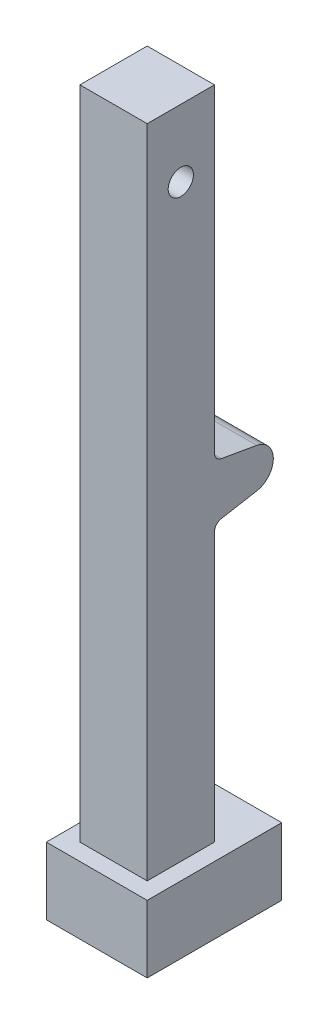
ISO-10303-21;
HEADER;
FILE_DESCRIPTION(('STEP AP214'),'2;1');
FILE_NAME('part.step','',(''),(''),'','','');
FILE_SCHEMA(('AUTOMOTIVE_DESIGN { 1 0 10303 214 1 1 1 1 }'));
ENDSEC;
DATA;
#1=APPLICATION_CONTEXT('core data for automotive mechanical design processes');
#2=APPLICATION_PROTOCOL_DEFINITION('international standard','automotive_design',2000,#1);
#3=PRODUCT_CONTEXT('',#1,'mechanical');
#4=PRODUCT('Part','Part','',(#3));
#5=PRODUCT_RELATED_PRODUCT_CATEGORY('part','',(#4));
#6=PRODUCT_DEFINITION_FORMATION('','',#4);
#7=PRODUCT_DEFINITION_CONTEXT('part definition',#1,'design');
#8=PRODUCT_DEFINITION('design','',#6,#7);
#9=PRODUCT_DEFINITION_SHAPE('','',#8);
#10=(LENGTH_UNIT() NAMED_UNIT(*) SI_UNIT(.MILLI.,.METRE.));
#11=(NAMED_UNIT(*) PLANE_ANGLE_UNIT() SI_UNIT($,.RADIAN.));
#12=(NAMED_UNIT(*) SI_UNIT($,.STERADIAN.) SOLID_ANGLE_UNIT());
#13=UNCERTAINTY_MEASURE_WITH_UNIT(LENGTH_MEASURE(1.E-05),#10,'distance_accuracy_value','');
#14=(GEOMETRIC_REPRESENTATION_CONTEXT(3) GLOBAL_UNCERTAINTY_ASSIGNED_CONTEXT((#13)) GLOBAL_UNIT_ASSIGNED_CONTEXT((#10,
#11,#12)) REPRESENTATION_CONTEXT('',''));
#15=CARTESIAN_POINT('',(0.,0.,0.));
#16=DIRECTION('',(0.,0.,1.));
#17=DIRECTION('',(1.,0.,0.));
#18=AXIS2_PLACEMENT_3D('',#15,#16,#17);
#19=CARTESIAN_POINT('',(-100.,-850.,-215.412320370289));
#20=DIRECTION('',(-1.,0.,0.));
#21=DIRECTION('',(0.,0.,1.));
#22=AXIS2_PLACEMENT_3D('',#19,#20,#21);
#23=CYLINDRICAL_SURFACE('',#22,59.5876796297106);
#24=DIRECTION('',(-1.,0.,0.));
#25=VECTOR('',#24,1.);
#26=CARTESIAN_POINT('',(-100.,-908.682408883347,-225.759612349389));
#27=LINE('',#26,#25);
#28=CARTESIAN_POINT('',(-100.,-908.682408883347,-225.759612349389));
#29=VERTEX_POINT('',#28);
#30=CARTESIAN_POINT('',(100.,-908.682408883347,-225.759612349389));
#31=VERTEX_POINT('',#30);
#32=EDGE_CURVE('E280',#29,#31,#27,.F.);
#33=ORIENTED_EDGE('',*,*,#32,.F.);
#34=CARTESIAN_POINT('',(-100.,-850.,-215.412320370289));
#35=DIRECTION('',(1.,0.,0.));
#36=DIRECTION('',(0.,0.,-1.));
#37=AXIS2_PLACEMENT_3D('',#34,#35,#36);
#38=CIRCLE('',#37,59.5876796297106);
#39=CARTESIAN_POINT('',(-100.,-791.317591116653,-225.759612349389));
#40=VERTEX_POINT('',#39);
#41=EDGE_CURVE('E286',#40,#29,#38,.F.);
#42=ORIENTED_EDGE('',*,*,#41,.F.);
#43=DIRECTION('',(-1.,0.,0.));
#44=VECTOR('',#43,1.);
#45=CARTESIAN_POINT('',(100.,-791.317591116653,-225.759612349389));
#46=LINE('',#45,#44);
#47=CARTESIAN_POINT('',(100.,-791.317591116653,-225.759612349389));
#48=VERTEX_POINT('',#47);
#49=EDGE_CURVE('E283',#48,#40,#46,.T.);
#50=ORIENTED_EDGE('',*,*,#49,.F.);
#51=CARTESIAN_POINT('',(100.,-850.,-215.412320370289));
#52=DIRECTION('',(1.,0.,0.));
#53=DIRECTION('',(0.,0.,-1.));
#54=AXIS2_PLACEMENT_3D('',#51,#52,#53);
#55=CIRCLE('',#54,59.5876796297106);
#56=EDGE_CURVE('E289',#31,#48,#55,.T.);
#57=ORIENTED_EDGE('',*,*,#56,.F.);
#58=EDGE_LOOP('',(#33,#42,#50,#57));
#59=FACE_BOUND('',#58,.T.);
#60=ADVANCED_FACE('F50',(#59),#23,.T.);
#61=CARTESIAN_POINT('',(100.,0.,-99.9999999999998));
#62=DIRECTION('',(0.,0.,-1.));
#63=DIRECTION('',(0.,1.,0.));
#64=AXIS2_PLACEMENT_3D('',#61,#62,#63);
#65=PLANE('',#64);
#66=DIRECTION('',(0.,-1.,0.));
#67=VECTOR('',#66,1.);
#68=CARTESIAN_POINT('',(-100.,0.,-99.9999999999998));
#69=LINE('',#68,#67);
#70=CARTESIAN_POINT('',(-100.,-1950.,-100.));
#71=VERTEX_POINT('',#70);
#72=CARTESIAN_POINT('',(-100.,-2000.,-100.));
#73=VERTEX_POINT('',#72);
#74=EDGE_CURVE('E244',#71,#73,#69,.T.);
#75=ORIENTED_EDGE('',*,*,#74,.F.);
#76=DIRECTION('',(1.,0.,0.));
#77=VECTOR('',#76,1.);
#78=CARTESIAN_POINT('',(100.,-1950.,-100.));
#79=LINE('',#78,#77);
#80=CARTESIAN_POINT('',(100.,-1950.,-100.));
#81=VERTEX_POINT('',#80);
#82=EDGE_CURVE('E214',#71,#81,#79,.T.);
#83=ORIENTED_EDGE('',*,*,#82,.T.);
#84=DIRECTION('',(0.,-1.,0.));
#85=VECTOR('',#84,1.);
#86=CARTESIAN_POINT('',(100.,0.,-99.9999999999998));
#87=LINE('',#86,#85);
#88=CARTESIAN_POINT('',(100.,-2000.,-100.));
#89=VERTEX_POINT('',#88);
#90=EDGE_CURVE('E222',#81,#89,#87,.T.);
#91=ORIENTED_EDGE('',*,*,#90,.T.);
#92=DIRECTION('',(-1.,0.,0.));
#93=VECTOR('',#92,1.);
#94=CARTESIAN_POINT('',(100.,-2000.,-100.));
#95=LINE('',#94,#93);
#96=EDGE_CURVE('E241',#89,#73,#95,.T.);
#97=ORIENTED_EDGE('',*,*,#96,.T.);
#98=EDGE_LOOP('',(#75,#83,#91,#97));
#99=FACE_BOUND('',#98,.T.);
#100=ADVANCED_FACE('F359',(#99),#65,.T.);
#101=CARTESIAN_POINT('',(100.,0.,99.9999999999998));
#102=DIRECTION('',(0.,0.,-1.));
#103=DIRECTION('',(0.,1.,0.));
#104=AXIS2_PLACEMENT_3D('',#101,#102,#103);
#105=PLANE('',#104);
#106=DIRECTION('',(1.,0.,0.));
#107=VECTOR('',#106,1.);
#108=CARTESIAN_POINT('',(100.,-1950.,100.));
#109=LINE('',#108,#107);
#110=CARTESIAN_POINT('',(-100.,-1950.,100.));
#111=VERTEX_POINT('',#110);
#112=CARTESIAN_POINT('',(100.,-1950.,100.));
#113=VERTEX_POINT('',#112);
#114=EDGE_CURVE('E211',#111,#113,#109,.T.);
#115=ORIENTED_EDGE('',*,*,#114,.F.);
#116=DIRECTION('',(0.,-1.,0.));
#117=VECTOR('',#116,1.);
#118=CARTESIAN_POINT('',(-100.,0.,99.9999999999998));
#119=LINE('',#118,#117);
#120=CARTESIAN_POINT('',(-100.,-2000.,100.));
#121=VERTEX_POINT('',#120);
#122=EDGE_CURVE('E255',#111,#121,#119,.T.);
#123=ORIENTED_EDGE('',*,*,#122,.T.);
#124=DIRECTION('',(-1.,0.,0.));
#125=VECTOR('',#124,1.);
#126=CARTESIAN_POINT('',(100.,-2000.,100.));
#127=LINE('',#126,#125);
#128=CARTESIAN_POINT('',(100.,-2000.,100.));
#129=VERTEX_POINT('',#128);
#130=EDGE_CURVE('E263',#129,#121,#127,.T.);
#131=ORIENTED_EDGE('',*,*,#130,.F.);
#132=DIRECTION('',(0.,-1.,0.));
#133=VECTOR('',#132,1.);
#134=CARTESIAN_POINT('',(100.,0.,99.9999999999998));
#135=LINE('',#134,#133);
#136=EDGE_CURVE('E234',#113,#129,#135,.T.);
#137=ORIENTED_EDGE('',*,*,#136,.F.);
#138=EDGE_LOOP('',(#115,#123,#131,#137));
#139=FACE_BOUND('',#138,.T.);
#140=ADVANCED_FACE('F366',(#139),#105,.F.);
#141=CARTESIAN_POINT('',(100.,0.,0.));
#142=DIRECTION('',(1.,0.,0.));
#143=DIRECTION('',(0.,0.,-1.));
#144=AXIS2_PLACEMENT_3D('',#141,#142,#143);
#145=PLANE('',#144);
#146=ORIENTED_EDGE('',*,*,#90,.F.);
#147=DIRECTION('',(0.,0.,1.));
#148=VECTOR('',#147,1.);
#149=CARTESIAN_POINT('',(100.,-1950.,0.));
#150=LINE('',#149,#148);
#151=EDGE_CURVE('E216',#81,#113,#150,.T.);
#152=ORIENTED_EDGE('',*,*,#151,.T.);
#153=ORIENTED_EDGE('',*,*,#136,.T.);
#154=DIRECTION('',(0.,0.,-1.));
#155=VECTOR('',#154,1.);
#156=CARTESIAN_POINT('',(100.,-2000.,0.));
#157=LINE('',#156,#155);
#158=EDGE_CURVE('E238',#129,#89,#157,.T.);
#159=ORIENTED_EDGE('',*,*,#158,.T.);
#160=EDGE_LOOP('',(#146,#152,#153,#159));
#161=FACE_BOUND('',#160,.T.);
#162=ADVANCED_FACE('F410',(#161),#145,.T.);
#163=CARTESIAN_POINT('',(-100.,0.,0.));
#164=DIRECTION('',(1.,0.,0.));
#165=DIRECTION('',(0.,0.,-1.));
#166=AXIS2_PLACEMENT_3D('',#163,#164,#165);
#167=PLANE('',#166);
#168=DIRECTION('',(0.,0.,1.));
#169=VECTOR('',#168,1.);
#170=CARTESIAN_POINT('',(-100.,-1950.,0.));
#171=LINE('',#170,#169);
#172=EDGE_CURVE('E277',#71,#111,#171,.T.);
#173=ORIENTED_EDGE('',*,*,#172,.F.);
#174=ORIENTED_EDGE('',*,*,#74,.T.);
#175=DIRECTION('',(0.,0.,-1.));
#176=VECTOR('',#175,1.);
#177=CARTESIAN_POINT('',(-100.,-2000.,0.));
#178=LINE('',#177,#176);
#179=EDGE_CURVE('E223',#121,#73,#178,.T.);
#180=ORIENTED_EDGE('',*,*,#179,.F.);
#181=ORIENTED_EDGE('',*,*,#122,.F.);
#182=EDGE_LOOP('',(#173,#174,#180,#181));
#183=FACE_BOUND('',#182,.T.);
#184=ADVANCED_FACE('F413',(#183),#167,.F.);
#185=CARTESIAN_POINT('',(100.,-2000.,0.));
#186=DIRECTION('',(0.,1.,0.));
#187=DIRECTION('',(0.,0.,1.));
#188=AXIS2_PLACEMENT_3D('',#185,#186,#187);
#189=PLANE('',#188);
#190=ORIENTED_EDGE('',*,*,#179,.T.);
#191=ORIENTED_EDGE('',*,*,#96,.F.);
#192=ORIENTED_EDGE('',*,*,#158,.F.);
#193=ORIENTED_EDGE('',*,*,#130,.T.);
#194=EDGE_LOOP('',(#190,#191,#192,#193));
#195=FACE_BOUND('',#194,.T.);
#196=ADVANCED_FACE('F406',(#195),#189,.F.);
#197=CARTESIAN_POINT('',(150.,-1950.,149.999999999999));
#198=DIRECTION('',(0.,1.,0.));
#199=DIRECTION('',(0.,0.,1.));
#200=AXIS2_PLACEMENT_3D('',#197,#198,#199);
#201=PLANE('',#200);
#202=ORIENTED_EDGE('',*,*,#151,.F.);
#203=ORIENTED_EDGE('',*,*,#82,.F.);
#204=ORIENTED_EDGE('',*,*,#172,.T.);
#205=ORIENTED_EDGE('',*,*,#114,.T.);
#206=EDGE_LOOP('',(#202,#203,#204,#205));
#207=FACE_BOUND('',#206,.T.);
#208=DIRECTION('',(0.,0.,-1.));
#209=VECTOR('',#208,1.);
#210=CARTESIAN_POINT('',(-150.,-1950.,149.999999999999));
#211=LINE('',#210,#209);
#212=CARTESIAN_POINT('',(-150.,-1950.,149.999999999999));
#213=VERTEX_POINT('',#212);
#214=CARTESIAN_POINT('',(-150.,-1950.,-250.000000000001));
#215=VERTEX_POINT('',#214);
#216=EDGE_CURVE('E197',#213,#215,#211,.T.);
#217=ORIENTED_EDGE('',*,*,#216,.T.);
#218=DIRECTION('',(-1.,0.,0.));
#219=VECTOR('',#218,1.);
#220=CARTESIAN_POINT('',(150.,-1950.,-250.000000000001));
#221=LINE('',#220,#219);
#222=CARTESIAN_POINT('',(150.,-1950.,-250.000000000001));
#223=VERTEX_POINT('',#222);
#224=EDGE_CURVE('E178',#223,#215,#221,.T.);
#225=ORIENTED_EDGE('',*,*,#224,.F.);
#226=DIRECTION('',(0.,0.,-1.));
#227=VECTOR('',#226,1.);
#228=CARTESIAN_POINT('',(150.,-1950.,149.999999999999));
#229=LINE('',#228,#227);
#230=CARTESIAN_POINT('',(150.,-1950.,149.999999999999));
#231=VERTEX_POINT('',#230);
#232=EDGE_CURVE('E185',#231,#223,#229,.T.);
#233=ORIENTED_EDGE('',*,*,#232,.F.);
#234=DIRECTION('',(-1.,0.,0.));
#235=VECTOR('',#234,1.);
#236=CARTESIAN_POINT('',(150.,-1950.,149.999999999999));
#237=LINE('',#236,#235);
#238=EDGE_CURVE('E582',#231,#213,#237,.T.);
#239=ORIENTED_EDGE('',*,*,#238,.T.);
#240=EDGE_LOOP('',(#217,#225,#233,#239));
#241=FACE_BOUND('',#240,.T.);
#242=ADVANCED_FACE('F195',(#207,#241),#201,.F.);
#243=CARTESIAN_POINT('',(150.,-1950.,-250.000000000001));
#244=DIRECTION('',(0.,0.,1.));
#245=DIRECTION('',(1.,0.,0.));
#246=AXIS2_PLACEMENT_3D('',#243,#244,#245);
#247=PLANE('',#246);
#248=DIRECTION('',(0.,1.,0.));
#249=VECTOR('',#248,1.);
#250=CARTESIAN_POINT('',(-150.,-1950.,-250.000000000001));
#251=LINE('',#250,#249);
#252=CARTESIAN_POINT('',(-150.,-1750.,-250.000000000001));
#253=VERTEX_POINT('',#252);
#254=EDGE_CURVE('E587',#215,#253,#251,.T.);
#255=ORIENTED_EDGE('',*,*,#254,.T.);
#256=DIRECTION('',(-1.,0.,0.));
#257=VECTOR('',#256,1.);
#258=CARTESIAN_POINT('',(150.,-1750.,-250.000000000001));
#259=LINE('',#258,#257);
#260=CARTESIAN_POINT('',(150.,-1750.,-250.000000000001));
#261=VERTEX_POINT('',#260);
#262=EDGE_CURVE('E180',#261,#253,#259,.T.);
#263=ORIENTED_EDGE('',*,*,#262,.F.);
#264=DIRECTION('',(0.,1.,0.));
#265=VECTOR('',#264,1.);
#266=CARTESIAN_POINT('',(150.,-1950.,-250.000000000001));
#267=LINE('',#266,#265);
#268=EDGE_CURVE('E173',#223,#261,#267,.T.);
#269=ORIENTED_EDGE('',*,*,#268,.F.);
#270=ORIENTED_EDGE('',*,*,#224,.T.);
#271=EDGE_LOOP('',(#255,#263,#269,#270));
#272=FACE_BOUND('',#271,.T.);
#273=ADVANCED_FACE('F176',(#272),#247,.F.);
#274=CARTESIAN_POINT('',(150.,-1750.,149.999999999999));
#275=DIRECTION('',(0.,1.,0.));
#276=DIRECTION('',(0.,0.,1.));
#277=AXIS2_PLACEMENT_3D('',#274,#275,#276);
#278=PLANE('',#277);
#279=DIRECTION('',(1.,0.,0.));
#280=VECTOR('',#279,1.);
#281=CARTESIAN_POINT('',(100.,-1750.,-100.));
#282=LINE('',#281,#280);
#283=CARTESIAN_POINT('',(-100.,-1750.,-99.9999999999999));
#284=VERTEX_POINT('',#283);
#285=CARTESIAN_POINT('',(100.,-1750.,-100.));
#286=VERTEX_POINT('',#285);
#287=EDGE_CURVE('E201',#284,#286,#282,.T.);
#288=ORIENTED_EDGE('',*,*,#287,.T.);
#289=DIRECTION('',(0.,0.,1.));
#290=VECTOR('',#289,1.);
#291=CARTESIAN_POINT('',(100.,-1750.,0.));
#292=LINE('',#291,#290);
#293=CARTESIAN_POINT('',(100.,-1750.,100.));
#294=VERTEX_POINT('',#293);
#295=EDGE_CURVE('E209',#286,#294,#292,.T.);
#296=ORIENTED_EDGE('',*,*,#295,.T.);
#297=DIRECTION('',(1.,0.,0.));
#298=VECTOR('',#297,1.);
#299=CARTESIAN_POINT('',(100.,-1750.,100.));
#300=LINE('',#299,#298);
#301=CARTESIAN_POINT('',(-100.,-1750.,100.));
#302=VERTEX_POINT('',#301);
#303=EDGE_CURVE('E198',#302,#294,#300,.T.);
#304=ORIENTED_EDGE('',*,*,#303,.F.);
#305=DIRECTION('',(0.,0.,1.));
#306=VECTOR('',#305,1.);
#307=CARTESIAN_POINT('',(-100.,-1750.,0.));
#308=LINE('',#307,#306);
#309=EDGE_CURVE('E270',#284,#302,#308,.T.);
#310=ORIENTED_EDGE('',*,*,#309,.F.);
#311=EDGE_LOOP('',(#288,#296,#304,#310));
#312=FACE_BOUND('',#311,.T.);
#313=DIRECTION('',(0.,0.,-1.));
#314=VECTOR('',#313,1.);
#315=CARTESIAN_POINT('',(-150.,-1750.,149.999999999999));
#316=LINE('',#315,#314);
#317=CARTESIAN_POINT('',(-150.,-1750.,149.999999999999));
#318=VERTEX_POINT('',#317);
#319=EDGE_CURVE('E585',#318,#253,#316,.T.);
#320=ORIENTED_EDGE('',*,*,#319,.F.);
#321=DIRECTION('',(-1.,0.,0.));
#322=VECTOR('',#321,1.);
#323=CARTESIAN_POINT('',(150.,-1750.,149.999999999999));
#324=LINE('',#323,#322);
#325=CARTESIAN_POINT('',(150.,-1750.,149.999999999999));
#326=VERTEX_POINT('',#325);
#327=EDGE_CURVE('E203',#326,#318,#324,.T.);
#328=ORIENTED_EDGE('',*,*,#327,.F.);
#329=DIRECTION('',(0.,0.,-1.));
#330=VECTOR('',#329,1.);
#331=CARTESIAN_POINT('',(150.,-1750.,149.999999999999));
#332=LINE('',#331,#330);
#333=EDGE_CURVE('E184',#326,#261,#332,.T.);
#334=ORIENTED_EDGE('',*,*,#333,.T.);
#335=ORIENTED_EDGE('',*,*,#262,.T.);
#336=EDGE_LOOP('',(#320,#328,#334,#335));
#337=FACE_BOUND('',#336,.T.);
#338=ADVANCED_FACE('F338',(#312,#337),#278,.T.);
#339=CARTESIAN_POINT('',(150.,-1950.,149.999999999999));
#340=DIRECTION('',(0.,0.,1.));
#341=DIRECTION('',(0.,-1.,0.));
#342=AXIS2_PLACEMENT_3D('',#339,#340,#341);
#343=PLANE('',#342);
#344=DIRECTION('',(0.,1.,0.));
#345=VECTOR('',#344,1.);
#346=CARTESIAN_POINT('',(-150.,-1950.,149.999999999999));
#347=LINE('',#346,#345);
#348=EDGE_CURVE('E193',#213,#318,#347,.T.);
#349=ORIENTED_EDGE('',*,*,#348,.F.);
#350=ORIENTED_EDGE('',*,*,#238,.F.);
#351=DIRECTION('',(0.,1.,0.));
#352=VECTOR('',#351,1.);
#353=CARTESIAN_POINT('',(150.,-1950.,149.999999999999));
#354=LINE('',#353,#352);
#355=EDGE_CURVE('E191',#231,#326,#354,.T.);
#356=ORIENTED_EDGE('',*,*,#355,.T.);
#357=ORIENTED_EDGE('',*,*,#327,.T.);
#358=EDGE_LOOP('',(#349,#350,#356,#357));
#359=FACE_BOUND('',#358,.T.);
#360=ADVANCED_FACE('F394',(#359),#343,.T.);
#361=CARTESIAN_POINT('',(150.,0.,0.));
#362=DIRECTION('',(1.,0.,0.));
#363=DIRECTION('',(0.,0.,-1.));
#364=AXIS2_PLACEMENT_3D('',#361,#362,#363);
#365=PLANE('',#364);
#366=ORIENTED_EDGE('',*,*,#232,.T.);
#367=ORIENTED_EDGE('',*,*,#268,.T.);
#368=ORIENTED_EDGE('',*,*,#333,.F.);
#369=ORIENTED_EDGE('',*,*,#355,.F.);
#370=EDGE_LOOP('',(#366,#367,#368,#369));
#371=FACE_BOUND('',#370,.T.);
#372=ADVANCED_FACE('F189',(#371),#365,.T.);
#373=CARTESIAN_POINT('',(-150.,0.,0.));
#374=DIRECTION('',(1.,0.,0.));
#375=DIRECTION('',(0.,0.,-1.));
#376=AXIS2_PLACEMENT_3D('',#373,#374,#375);
#377=PLANE('',#376);
#378=ORIENTED_EDGE('',*,*,#216,.F.);
#379=ORIENTED_EDGE('',*,*,#348,.T.);
#380=ORIENTED_EDGE('',*,*,#319,.T.);
#381=ORIENTED_EDGE('',*,*,#254,.F.);
#382=EDGE_LOOP('',(#378,#379,#380,#381));
#383=FACE_BOUND('',#382,.T.);
#384=ADVANCED_FACE('F385',(#383),#377,.F.);
#385=CARTESIAN_POINT('',(100.,-900.,-275.));
#386=DIRECTION('',(0.,-0.984807753012208,-0.173648177666931));
#387=DIRECTION('',(0.,0.173648177666931,-0.984807753012208));
#388=AXIS2_PLACEMENT_3D('',#385,#386,#387);
#389=PLANE('',#388);
#390=DIRECTION('',(0.,-0.173648177666931,0.984807753012208));
#391=VECTOR('',#390,1.);
#392=CARTESIAN_POINT('',(100.,-900.,-275.));
#393=LINE('',#392,#391);
#394=CARTESIAN_POINT('',(100.,-927.214518578108,-120.658795558327));
#395=VERTEX_POINT('',#394);
#396=EDGE_CURVE('E226',#395,#31,#393,.F.);
#397=ORIENTED_EDGE('',*,*,#396,.F.);
#398=DIRECTION('',(-1.,0.,0.));
#399=VECTOR('',#398,1.);
#400=CARTESIAN_POINT('',(100.,-927.214518578108,-120.658795558327));
#401=LINE('',#400,#399);
#402=CARTESIAN_POINT('',(-100.,-927.214518578108,-120.658795558327));
#403=VERTEX_POINT('',#402);
#404=EDGE_CURVE('E297',#395,#403,#401,.T.);
#405=ORIENTED_EDGE('',*,*,#404,.T.);
#406=DIRECTION('',(0.,-0.173648177666931,0.984807753012208));
#407=VECTOR('',#406,1.);
#408=CARTESIAN_POINT('',(-100.,-900.,-275.));
#409=LINE('',#408,#407);
#410=EDGE_CURVE('E247',#403,#29,#409,.F.);
#411=ORIENTED_EDGE('',*,*,#410,.T.);
#412=ORIENTED_EDGE('',*,*,#32,.T.);
#413=EDGE_LOOP('',(#397,#405,#411,#412));
#414=FACE_BOUND('',#413,.T.);
#415=ADVANCED_FACE('F329',(#414),#389,.T.);
#416=CARTESIAN_POINT('',(100.,-800.,-275.));
#417=DIRECTION('',(0.,0.984807753012208,-0.173648177666931));
#418=DIRECTION('',(0.,0.173648177666931,0.984807753012208));
#419=AXIS2_PLACEMENT_3D('',#416,#417,#418);
#420=PLANE('',#419);
#421=DIRECTION('',(0.,-0.173648177666931,-0.984807753012208));
#422=VECTOR('',#421,1.);
#423=CARTESIAN_POINT('',(-100.,-800.,-275.));
#424=LINE('',#423,#422);
#425=CARTESIAN_POINT('',(-100.,-772.785481421892,-120.658795558327));
#426=VERTEX_POINT('',#425);
#427=EDGE_CURVE('E252',#426,#40,#424,.T.);
#428=ORIENTED_EDGE('',*,*,#427,.F.);
#429=DIRECTION('',(-1.,0.,0.));
#430=VECTOR('',#429,1.);
#431=CARTESIAN_POINT('',(100.,-772.785481421892,-120.658795558327));
#432=LINE('',#431,#430);
#433=CARTESIAN_POINT('',(100.,-772.785481421892,-120.658795558327));
#434=VERTEX_POINT('',#433);
#435=EDGE_CURVE('E295',#426,#434,#432,.F.);
#436=ORIENTED_EDGE('',*,*,#435,.T.);
#437=DIRECTION('',(0.,-0.173648177666931,-0.984807753012208));
#438=VECTOR('',#437,1.);
#439=CARTESIAN_POINT('',(100.,-800.,-275.));
#440=LINE('',#439,#438);
#441=EDGE_CURVE('E231',#434,#48,#440,.T.);
#442=ORIENTED_EDGE('',*,*,#441,.T.);
#443=ORIENTED_EDGE('',*,*,#49,.T.);
#444=EDGE_LOOP('',(#428,#436,#442,#443));
#445=FACE_BOUND('',#444,.T.);
#446=ADVANCED_FACE('F322',(#445),#420,.T.);
#447=CARTESIAN_POINT('',(100.,0.,-99.9999999999998));
#448=DIRECTION('',(0.,0.,-1.));
#449=DIRECTION('',(0.,1.,0.));
#450=AXIS2_PLACEMENT_3D('',#447,#448,#449);
#451=PLANE('',#450);
#452=DIRECTION('',(0.,-1.,0.));
#453=VECTOR('',#452,1.);
#454=CARTESIAN_POINT('',(100.,0.,-99.9999999999998));
#455=LINE('',#454,#453);
#456=CARTESIAN_POINT('',(100.,200.,-99.9999999999998));
#457=VERTEX_POINT('',#456);
#458=CARTESIAN_POINT('',(100.,-748.165287596586,-99.9999999999998));
#459=VERTEX_POINT('',#458);
#460=EDGE_CURVE('E227',#457,#459,#455,.T.);
#461=ORIENTED_EDGE('',*,*,#460,.T.);
#462=DIRECTION('',(-1.,0.,0.));
#463=VECTOR('',#462,1.);
#464=CARTESIAN_POINT('',(-100.,-748.165287596586,-99.9999999999998));
#465=LINE('',#464,#463);
#466=CARTESIAN_POINT('',(-100.,-748.165287596586,-99.9999999999998));
#467=VERTEX_POINT('',#466);
#468=EDGE_CURVE('E292',#459,#467,#465,.T.);
#469=ORIENTED_EDGE('',*,*,#468,.T.);
#470=DIRECTION('',(0.,-1.,0.));
#471=VECTOR('',#470,1.);
#472=CARTESIAN_POINT('',(-100.,0.,-99.9999999999998));
#473=LINE('',#472,#471);
#474=CARTESIAN_POINT('',(-100.,200.,-99.9999999999998));
#475=VERTEX_POINT('',#474);
#476=EDGE_CURVE('E248',#475,#467,#473,.T.);
#477=ORIENTED_EDGE('',*,*,#476,.F.);
#478=DIRECTION('',(-1.,0.,0.));
#479=VECTOR('',#478,1.);
#480=CARTESIAN_POINT('',(100.,200.,-99.9999999999998));
#481=LINE('',#480,#479);
#482=EDGE_CURVE('E268',#457,#475,#481,.T.);
#483=ORIENTED_EDGE('',*,*,#482,.F.);
#484=EDGE_LOOP('',(#461,#469,#477,#483));
#485=FACE_BOUND('',#484,.T.);
#486=ADVANCED_FACE('F315',(#485),#451,.T.);
#487=CARTESIAN_POINT('',(100.,200.,0.));
#488=DIRECTION('',(0.,1.,0.));
#489=DIRECTION('',(0.,0.,1.));
#490=AXIS2_PLACEMENT_3D('',#487,#488,#489);
#491=PLANE('',#490);
#492=DIRECTION('',(0.,0.,-1.));
#493=VECTOR('',#492,1.);
#494=CARTESIAN_POINT('',(-100.,200.,0.));
#495=LINE('',#494,#493);
#496=CARTESIAN_POINT('',(-100.,200.,99.9999999999998));
#497=VERTEX_POINT('',#496);
#498=EDGE_CURVE('E251',#497,#475,#495,.T.);
#499=ORIENTED_EDGE('',*,*,#498,.F.);
#500=DIRECTION('',(-1.,0.,0.));
#501=VECTOR('',#500,1.);
#502=CARTESIAN_POINT('',(100.,200.,99.9999999999998));
#503=LINE('',#502,#501);
#504=CARTESIAN_POINT('',(100.,200.,99.9999999999998));
#505=VERTEX_POINT('',#504);
#506=EDGE_CURVE('E266',#505,#497,#503,.T.);
#507=ORIENTED_EDGE('',*,*,#506,.F.);
#508=DIRECTION('',(0.,0.,-1.));
#509=VECTOR('',#508,1.);
#510=CARTESIAN_POINT('',(100.,200.,0.));
#511=LINE('',#510,#509);
#512=EDGE_CURVE('E230',#505,#457,#511,.T.);
#513=ORIENTED_EDGE('',*,*,#512,.T.);
#514=ORIENTED_EDGE('',*,*,#482,.T.);
#515=EDGE_LOOP('',(#499,#507,#513,#514));
#516=FACE_BOUND('',#515,.T.);
#517=ADVANCED_FACE('F346',(#516),#491,.T.);
#518=CARTESIAN_POINT('',(100.,0.,0.));
#519=DIRECTION('',(-1.,0.,0.));
#520=DIRECTION('',(0.,0.,1.));
#521=AXIS2_PLACEMENT_3D('',#518,#519,#520);
#522=CYLINDRICAL_SURFACE('',#521,37.5);
#523=CARTESIAN_POINT('',(100.,0.,0.));
#524=DIRECTION('',(1.,0.,0.));
#525=DIRECTION('',(0.,0.,-1.));
#526=AXIS2_PLACEMENT_3D('',#523,#524,#525);
#527=CIRCLE('',#526,37.5);
#528=CARTESIAN_POINT('',(100.,0.,-37.5));
#529=VERTEX_POINT('',#528);
#530=EDGE_CURVE('E219',#529,#529,#527,.T.);
#531=ORIENTED_EDGE('',*,*,#530,.T.);
#532=EDGE_LOOP('',(#531));
#533=FACE_BOUND('',#532,.T.);
#534=CARTESIAN_POINT('',(-100.,0.,0.));
#535=DIRECTION('',(1.,0.,0.));
#536=DIRECTION('',(0.,0.,-1.));
#537=AXIS2_PLACEMENT_3D('',#534,#535,#536);
#538=CIRCLE('',#537,37.5);
#539=CARTESIAN_POINT('',(-100.,0.,-37.5));
#540=VERTEX_POINT('',#539);
#541=EDGE_CURVE('E218',#540,#540,#538,.T.);
#542=ORIENTED_EDGE('',*,*,#541,.F.);
#543=EDGE_LOOP('',(#542));
#544=FACE_BOUND('',#543,.T.);
#545=ADVANCED_FACE('F348',(#533,#544),#522,.F.);
#546=CARTESIAN_POINT('',(100.,-951.834712403413,-99.9999999999999));
#547=VERTEX_POINT('',#546);
#548=EDGE_CURVE('E224',#547,#286,#87,.T.);
#549=ORIENTED_EDGE('',*,*,#548,.F.);
#550=CARTESIAN_POINT('',(100.,-951.834712403413,-125.));
#551=DIRECTION('',(1.,0.,0.));
#552=DIRECTION('',(0.,0.,-1.));
#553=AXIS2_PLACEMENT_3D('',#550,#551,#552);
#554=CIRCLE('',#553,25.);
#555=EDGE_CURVE('E12',#547,#395,#554,.F.);
#556=ORIENTED_EDGE('',*,*,#555,.T.);
#557=ORIENTED_EDGE('',*,*,#396,.T.);
#558=ORIENTED_EDGE('',*,*,#56,.T.);
#559=ORIENTED_EDGE('',*,*,#441,.F.);
#560=CARTESIAN_POINT('',(100.,-748.165287596586,-125.));
#561=DIRECTION('',(1.,0.,0.));
#562=DIRECTION('',(0.,0.,-1.));
#563=AXIS2_PLACEMENT_3D('',#560,#561,#562);
#564=CIRCLE('',#563,25.);
#565=EDGE_CURVE('E303',#434,#459,#564,.F.);
#566=ORIENTED_EDGE('',*,*,#565,.T.);
#567=ORIENTED_EDGE('',*,*,#460,.F.);
#568=ORIENTED_EDGE('',*,*,#512,.F.);
#569=EDGE_CURVE('E235',#505,#294,#135,.T.);
#570=ORIENTED_EDGE('',*,*,#569,.T.);
#571=ORIENTED_EDGE('',*,*,#295,.F.);
#572=EDGE_LOOP('',(#549,#556,#557,#558,#559,#566,#567,#568,#570,#571));
#573=FACE_BOUND('',#572,.T.);
#574=ORIENTED_EDGE('',*,*,#530,.F.);
#575=EDGE_LOOP('',(#574));
#576=FACE_BOUND('',#575,.T.);
#577=ADVANCED_FACE('F308',(#573,#576),#145,.T.);
#578=ORIENTED_EDGE('',*,*,#541,.T.);
#579=EDGE_LOOP('',(#578));
#580=FACE_BOUND('',#579,.T.);
#581=ORIENTED_EDGE('',*,*,#476,.T.);
#582=CARTESIAN_POINT('',(-100.,-748.165287596586,-125.));
#583=DIRECTION('',(1.,0.,0.));
#584=DIRECTION('',(0.,0.,-1.));
#585=AXIS2_PLACEMENT_3D('',#582,#583,#584);
#586=CIRCLE('',#585,25.);
#587=EDGE_CURVE('E301',#467,#426,#586,.T.);
#588=ORIENTED_EDGE('',*,*,#587,.T.);
#589=ORIENTED_EDGE('',*,*,#427,.T.);
#590=ORIENTED_EDGE('',*,*,#41,.T.);
#591=ORIENTED_EDGE('',*,*,#410,.F.);
#592=CARTESIAN_POINT('',(-100.,-951.834712403413,-125.));
#593=DIRECTION('',(1.,0.,0.));
#594=DIRECTION('',(0.,0.,-1.));
#595=AXIS2_PLACEMENT_3D('',#592,#593,#594);
#596=CIRCLE('',#595,25.);
#597=CARTESIAN_POINT('',(-100.,-951.834712403413,-99.9999999999999));
#598=VERTEX_POINT('',#597);
#599=EDGE_CURVE('E58',#403,#598,#596,.T.);
#600=ORIENTED_EDGE('',*,*,#599,.T.);
#601=EDGE_CURVE('E245',#598,#284,#69,.T.);
#602=ORIENTED_EDGE('',*,*,#601,.T.);
#603=ORIENTED_EDGE('',*,*,#309,.T.);
#604=EDGE_CURVE('E256',#497,#302,#119,.T.);
#605=ORIENTED_EDGE('',*,*,#604,.F.);
#606=ORIENTED_EDGE('',*,*,#498,.T.);
#607=EDGE_LOOP('',(#581,#588,#589,#590,#591,#600,#602,#603,#605,#606));
#608=FACE_BOUND('',#607,.T.);
#609=ADVANCED_FACE('F319',(#580,#608),#167,.F.);
#610=ORIENTED_EDGE('',*,*,#604,.T.);
#611=ORIENTED_EDGE('',*,*,#303,.T.);
#612=ORIENTED_EDGE('',*,*,#569,.F.);
#613=ORIENTED_EDGE('',*,*,#506,.T.);
#614=EDGE_LOOP('',(#610,#611,#612,#613));
#615=FACE_BOUND('',#614,.T.);
#616=ADVANCED_FACE('F343',(#615),#105,.F.);
#617=ORIENTED_EDGE('',*,*,#601,.F.);
#618=DIRECTION('',(1.,0.,0.));
#619=VECTOR('',#618,1.);
#620=CARTESIAN_POINT('',(100.,-951.834712403413,-99.9999999999999));
#621=LINE('',#620,#619);
#622=EDGE_CURVE('E65',#598,#547,#621,.T.);
#623=ORIENTED_EDGE('',*,*,#622,.T.);
#624=ORIENTED_EDGE('',*,*,#548,.T.);
#625=ORIENTED_EDGE('',*,*,#287,.F.);
#626=EDGE_LOOP('',(#617,#623,#624,#625));
#627=FACE_BOUND('',#626,.T.);
#628=ADVANCED_FACE('F335',(#627),#65,.T.);
#629=CARTESIAN_POINT('',(100.,-748.165287596586,-125.));
#630=DIRECTION('',(1.,0.,0.));
#631=DIRECTION('',(0.,0.,-1.));
#632=AXIS2_PLACEMENT_3D('',#629,#630,#631);
#633=CYLINDRICAL_SURFACE('',#632,25.);
#634=ORIENTED_EDGE('',*,*,#565,.F.);
#635=ORIENTED_EDGE('',*,*,#435,.F.);
#636=ORIENTED_EDGE('',*,*,#587,.F.);
#637=ORIENTED_EDGE('',*,*,#468,.F.);
#638=EDGE_LOOP('',(#634,#635,#636,#637));
#639=FACE_BOUND('',#638,.T.);
#640=ADVANCED_FACE('F317',(#639),#633,.F.);
#641=CARTESIAN_POINT('',(100.,-951.834712403413,-125.));
#642=DIRECTION('',(1.,0.,0.));
#643=DIRECTION('',(0.,0.,-1.));
#644=AXIS2_PLACEMENT_3D('',#641,#642,#643);
#645=CYLINDRICAL_SURFACE('',#644,25.);
#646=ORIENTED_EDGE('',*,*,#555,.F.);
#647=ORIENTED_EDGE('',*,*,#622,.F.);
#648=ORIENTED_EDGE('',*,*,#599,.F.);
#649=ORIENTED_EDGE('',*,*,#404,.F.);
#650=EDGE_LOOP('',(#646,#647,#648,#649));
#651=FACE_BOUND('',#650,.T.);
#652=ADVANCED_FACE('F52',(#651),#645,.F.);
#653=CLOSED_SHELL('',(#60,#100,#140,#162,#184,#196,#242,#273,#338,#360,#372,#384,#415,#446,#486,
#517,#545,#577,#609,#616,#628,#640,#652));
#654=MANIFOLD_SOLID_BREP('B2',#653);
#655=ADVANCED_BREP_SHAPE_REPRESENTATION('',(#18,#654),#14);
#656=SHAPE_DEFINITION_REPRESENTATION(#9,#655);
ENDSEC;
END-ISO-10303-21;
